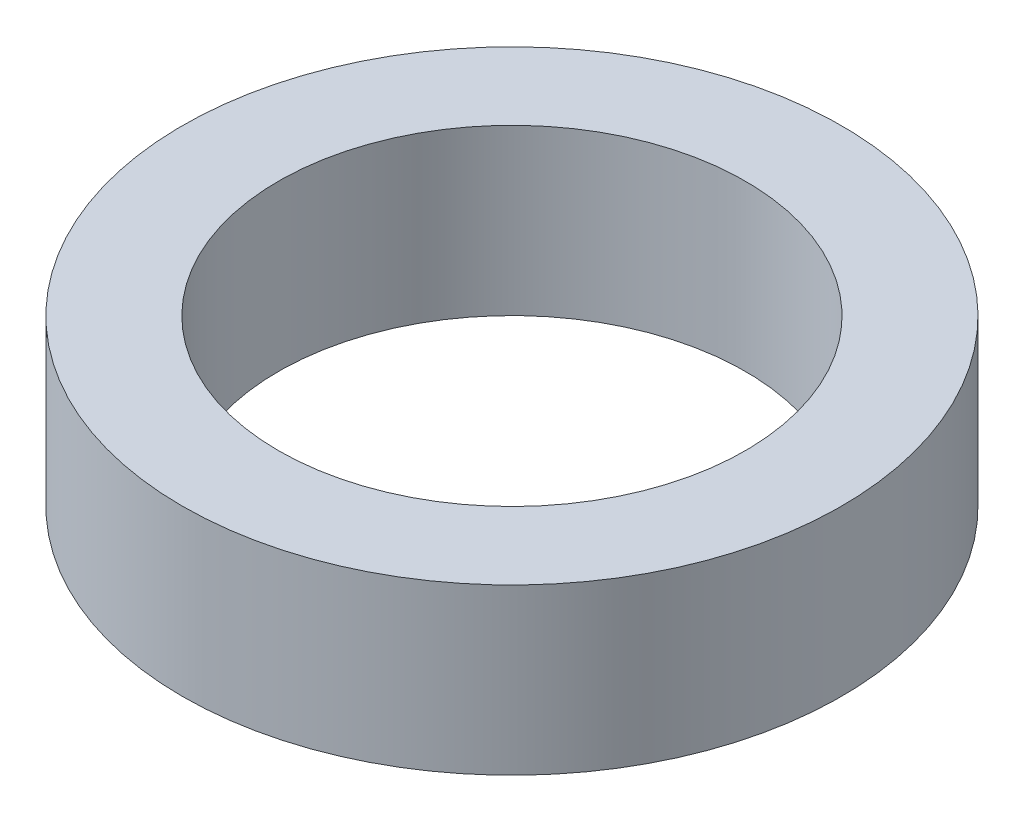
ISO-10303-21;
HEADER;
FILE_DESCRIPTION(('STEP AP214'),'2;1');
FILE_NAME('part.step','',(''),(''),'','','');
FILE_SCHEMA(('AUTOMOTIVE_DESIGN { 1 0 10303 214 1 1 1 1 }'));
ENDSEC;
DATA;
#1=APPLICATION_CONTEXT('core data for automotive mechanical design processes');
#2=APPLICATION_PROTOCOL_DEFINITION('international standard','automotive_design',2000,#1);
#3=PRODUCT_CONTEXT('',#1,'mechanical');
#4=PRODUCT('Part','Part','',(#3));
#5=PRODUCT_RELATED_PRODUCT_CATEGORY('part','',(#4));
#6=PRODUCT_DEFINITION_FORMATION('','',#4);
#7=PRODUCT_DEFINITION_CONTEXT('part definition',#1,'design');
#8=PRODUCT_DEFINITION('design','',#6,#7);
#9=PRODUCT_DEFINITION_SHAPE('','',#8);
#10=(LENGTH_UNIT() NAMED_UNIT(*) SI_UNIT(.MILLI.,.METRE.));
#11=(NAMED_UNIT(*) PLANE_ANGLE_UNIT() SI_UNIT($,.RADIAN.));
#12=(NAMED_UNIT(*) SI_UNIT($,.STERADIAN.) SOLID_ANGLE_UNIT());
#13=UNCERTAINTY_MEASURE_WITH_UNIT(LENGTH_MEASURE(1.E-05),#10,'distance_accuracy_value','');
#14=(GEOMETRIC_REPRESENTATION_CONTEXT(3) GLOBAL_UNCERTAINTY_ASSIGNED_CONTEXT((#13)) GLOBAL_UNIT_ASSIGNED_CONTEXT((#10,
#11,#12)) REPRESENTATION_CONTEXT('',''));
#15=CARTESIAN_POINT('',(0.,0.,0.));
#16=DIRECTION('',(0.,0.,1.));
#17=DIRECTION('',(1.,0.,0.));
#18=AXIS2_PLACEMENT_3D('',#15,#16,#17);
#19=CARTESIAN_POINT('',(0.,30.,0.));
#20=DIRECTION('',(0.,-1.,0.));
#21=DIRECTION('',(0.,0.,-1.));
#22=AXIS2_PLACEMENT_3D('',#19,#20,#21);
#23=CYLINDRICAL_SURFACE('',#22,60.);
#24=CARTESIAN_POINT('',(0.,30.,0.));
#25=DIRECTION('',(0.,1.,0.));
#26=DIRECTION('',(0.,0.,1.));
#27=AXIS2_PLACEMENT_3D('',#24,#25,#26);
#28=CIRCLE('',#27,60.);
#29=CARTESIAN_POINT('',(0.,30.,60.));
#30=VERTEX_POINT('',#29);
#31=EDGE_CURVE('E10',#30,#30,#28,.T.);
#32=ORIENTED_EDGE('',*,*,#31,.F.);
#33=EDGE_LOOP('',(#32));
#34=FACE_BOUND('',#33,.T.);
#35=CARTESIAN_POINT('',(0.,0.,0.));
#36=DIRECTION('',(0.,1.,0.));
#37=DIRECTION('',(0.,0.,1.));
#38=AXIS2_PLACEMENT_3D('',#35,#36,#37);
#39=CIRCLE('',#38,60.);
#40=CARTESIAN_POINT('',(0.,0.,60.));
#41=VERTEX_POINT('',#40);
#42=EDGE_CURVE('E37',#41,#41,#39,.T.);
#43=ORIENTED_EDGE('',*,*,#42,.T.);
#44=EDGE_LOOP('',(#43));
#45=FACE_BOUND('',#44,.T.);
#46=ADVANCED_FACE('F40',(#34,#45),#23,.T.);
#47=CARTESIAN_POINT('',(0.,30.,0.));
#48=DIRECTION('',(0.,1.,0.));
#49=DIRECTION('',(0.,0.,1.));
#50=AXIS2_PLACEMENT_3D('',#47,#48,#49);
#51=PLANE('',#50);
#52=CARTESIAN_POINT('',(0.,30.,0.));
#53=DIRECTION('',(0.,1.,0.));
#54=DIRECTION('',(0.,0.,1.));
#55=AXIS2_PLACEMENT_3D('',#52,#53,#54);
#56=CIRCLE('',#55,42.5);
#57=CARTESIAN_POINT('',(0.,30.,42.5));
#58=VERTEX_POINT('',#57);
#59=EDGE_CURVE('E50',#58,#58,#56,.T.);
#60=ORIENTED_EDGE('',*,*,#59,.F.);
#61=EDGE_LOOP('',(#60));
#62=FACE_BOUND('',#61,.T.);
#63=ORIENTED_EDGE('',*,*,#31,.T.);
#64=EDGE_LOOP('',(#63));
#65=FACE_BOUND('',#64,.T.);
#66=ADVANCED_FACE('F59',(#62,#65),#51,.T.);
#67=CARTESIAN_POINT('',(0.,0.,0.));
#68=DIRECTION('',(0.,1.,0.));
#69=DIRECTION('',(0.,0.,1.));
#70=AXIS2_PLACEMENT_3D('',#67,#68,#69);
#71=PLANE('',#70);
#72=CARTESIAN_POINT('',(0.,0.,0.));
#73=DIRECTION('',(0.,1.,0.));
#74=DIRECTION('',(0.,0.,1.));
#75=AXIS2_PLACEMENT_3D('',#72,#73,#74);
#76=CIRCLE('',#75,42.5);
#77=CARTESIAN_POINT('',(0.,0.,42.5));
#78=VERTEX_POINT('',#77);
#79=EDGE_CURVE('E47',#78,#78,#76,.T.);
#80=ORIENTED_EDGE('',*,*,#79,.T.);
#81=EDGE_LOOP('',(#80));
#82=FACE_BOUND('',#81,.T.);
#83=ORIENTED_EDGE('',*,*,#42,.F.);
#84=EDGE_LOOP('',(#83));
#85=FACE_BOUND('',#84,.T.);
#86=ADVANCED_FACE('F58',(#82,#85),#71,.F.);
#87=CARTESIAN_POINT('',(0.,30.,0.));
#88=DIRECTION('',(0.,-1.,0.));
#89=DIRECTION('',(0.,0.,-1.));
#90=AXIS2_PLACEMENT_3D('',#87,#88,#89);
#91=CYLINDRICAL_SURFACE('',#90,42.5);
#92=ORIENTED_EDGE('',*,*,#59,.T.);
#93=EDGE_LOOP('',(#92));
#94=FACE_BOUND('',#93,.T.);
#95=ORIENTED_EDGE('',*,*,#79,.F.);
#96=EDGE_LOOP('',(#95));
#97=FACE_BOUND('',#96,.T.);
#98=ADVANCED_FACE('F54',(#94,#97),#91,.F.);
#99=CLOSED_SHELL('',(#46,#66,#86,#98));
#100=MANIFOLD_SOLID_BREP('B2',#99);
#101=ADVANCED_BREP_SHAPE_REPRESENTATION('',(#18,#100),#14);
#102=SHAPE_DEFINITION_REPRESENTATION(#9,#101);
ENDSEC;
END-ISO-10303-21;
